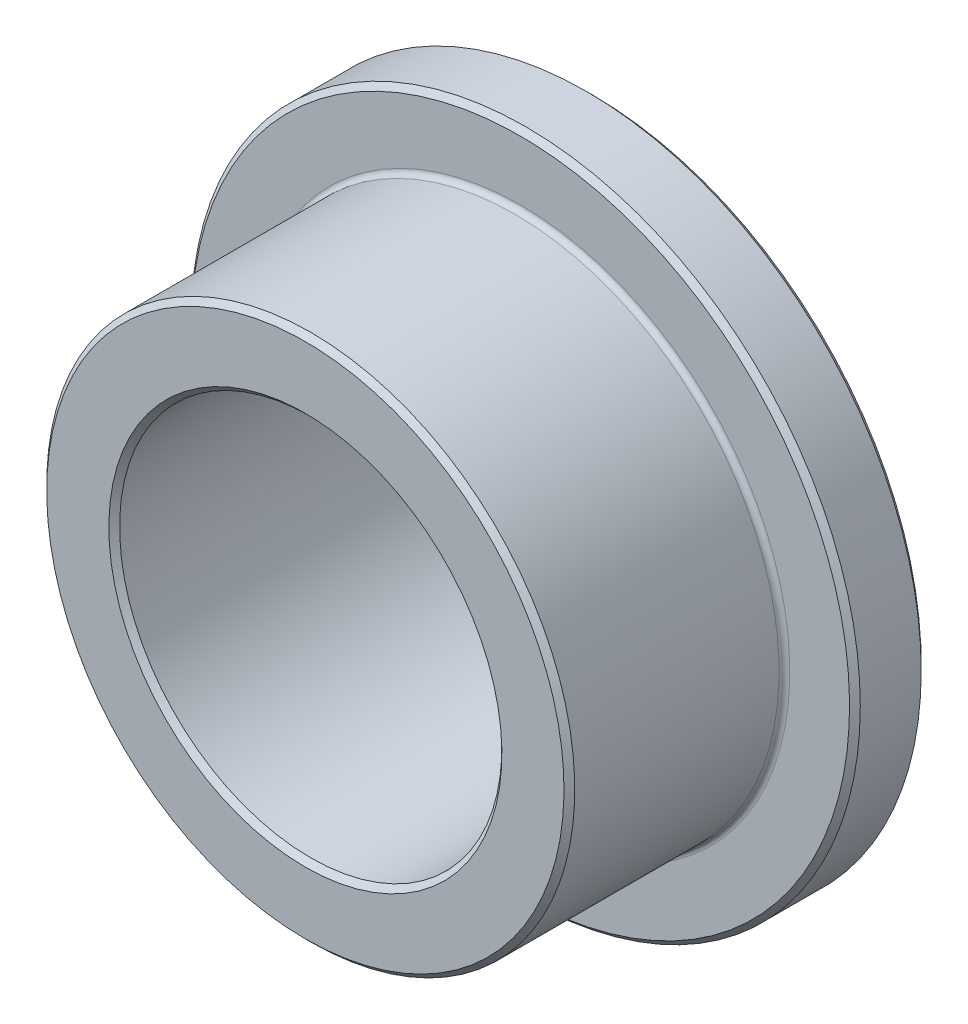
ISO-10303-21;
HEADER;
FILE_DESCRIPTION(('STEP AP214'),'2;1');
FILE_NAME('part.step','',(''),(''),'','','');
FILE_SCHEMA(('AUTOMOTIVE_DESIGN { 1 0 10303 214 1 1 1 1 }'));
ENDSEC;
DATA;
#1=APPLICATION_CONTEXT('core data for automotive mechanical design processes');
#2=APPLICATION_PROTOCOL_DEFINITION('international standard','automotive_design',2000,#1);
#3=PRODUCT_CONTEXT('',#1,'mechanical');
#4=PRODUCT('Part','Part','',(#3));
#5=PRODUCT_RELATED_PRODUCT_CATEGORY('part','',(#4));
#6=PRODUCT_DEFINITION_FORMATION('','',#4);
#7=PRODUCT_DEFINITION_CONTEXT('part definition',#1,'design');
#8=PRODUCT_DEFINITION('design','',#6,#7);
#9=PRODUCT_DEFINITION_SHAPE('','',#8);
#10=(LENGTH_UNIT() NAMED_UNIT(*) SI_UNIT(.MILLI.,.METRE.));
#11=(NAMED_UNIT(*) PLANE_ANGLE_UNIT() SI_UNIT($,.RADIAN.));
#12=(NAMED_UNIT(*) SI_UNIT($,.STERADIAN.) SOLID_ANGLE_UNIT());
#13=UNCERTAINTY_MEASURE_WITH_UNIT(LENGTH_MEASURE(1.E-05),#10,'distance_accuracy_value','');
#14=(GEOMETRIC_REPRESENTATION_CONTEXT(3) GLOBAL_UNCERTAINTY_ASSIGNED_CONTEXT((#13)) GLOBAL_UNIT_ASSIGNED_CONTEXT((#10,
#11,#12)) REPRESENTATION_CONTEXT('',''));
#15=CARTESIAN_POINT('',(0.,0.,0.));
#16=DIRECTION('',(0.,0.,1.));
#17=DIRECTION('',(1.,0.,0.));
#18=AXIS2_PLACEMENT_3D('',#15,#16,#17);
#19=CARTESIAN_POINT('',(0.,7.,-3.));
#20=DIRECTION('',(0.,0.,-1.));
#21=DIRECTION('',(0.,1.,0.));
#22=AXIS2_PLACEMENT_3D('',#19,#20,#21);
#23=PLANE('',#22);
#24=CARTESIAN_POINT('',(0.,0.,-3.));
#25=DIRECTION('',(0.,0.,-1.));
#26=DIRECTION('',(0.,1.,0.));
#27=AXIS2_PLACEMENT_3D('',#24,#25,#26);
#28=CIRCLE('',#27,6.8875);
#29=CARTESIAN_POINT('',(0.,6.8875,-3.));
#30=VERTEX_POINT('',#29);
#31=EDGE_CURVE('E70',#30,#30,#28,.T.);
#32=ORIENTED_EDGE('',*,*,#31,.T.);
#33=EDGE_LOOP('',(#32));
#34=FACE_BOUND('',#33,.T.);
#35=CARTESIAN_POINT('',(0.,0.,-3.));
#36=DIRECTION('',(0.,0.,-1.));
#37=DIRECTION('',(0.,1.,0.));
#38=AXIS2_PLACEMENT_3D('',#35,#36,#37);
#39=CIRCLE('',#38,4.);
#40=CARTESIAN_POINT('',(0.,4.,-3.));
#41=VERTEX_POINT('',#40);
#42=EDGE_CURVE('E73',#41,#41,#39,.T.);
#43=ORIENTED_EDGE('',*,*,#42,.F.);
#44=EDGE_LOOP('',(#43));
#45=FACE_BOUND('',#44,.T.);
#46=ADVANCED_FACE('F35',(#34,#45),#23,.T.);
#47=CARTESIAN_POINT('',(0.,0.,-3.));
#48=DIRECTION('',(0.,0.,-1.));
#49=DIRECTION('',(0.,1.,0.));
#50=AXIS2_PLACEMENT_3D('',#47,#48,#49);
#51=CYLINDRICAL_SURFACE('',#50,7.);
#52=CARTESIAN_POINT('',(0.,0.,-2.8875));
#53=DIRECTION('',(0.,0.,-1.));
#54=DIRECTION('',(0.,1.,0.));
#55=AXIS2_PLACEMENT_3D('',#52,#53,#54);
#56=CIRCLE('',#55,7.);
#57=CARTESIAN_POINT('',(0.,7.,-2.8875));
#58=VERTEX_POINT('',#57);
#59=EDGE_CURVE('E64',#58,#58,#56,.F.);
#60=ORIENTED_EDGE('',*,*,#59,.T.);
#61=EDGE_LOOP('',(#60));
#62=FACE_BOUND('',#61,.T.);
#63=CARTESIAN_POINT('',(0.,0.,-1.6125));
#64=DIRECTION('',(0.,0.,1.));
#65=DIRECTION('',(0.,-1.,0.));
#66=AXIS2_PLACEMENT_3D('',#63,#64,#65);
#67=CIRCLE('',#66,7.);
#68=CARTESIAN_POINT('',(0.,-7.,-1.6125));
#69=VERTEX_POINT('',#68);
#70=EDGE_CURVE('E67',#69,#69,#67,.F.);
#71=ORIENTED_EDGE('',*,*,#70,.T.);
#72=EDGE_LOOP('',(#71));
#73=FACE_BOUND('',#72,.T.);
#74=ADVANCED_FACE('F80',(#62,#73),#51,.T.);
#75=CARTESIAN_POINT('',(0.,7.,-1.5));
#76=DIRECTION('',(0.,0.,1.));
#77=DIRECTION('',(0.,-1.,0.));
#78=AXIS2_PLACEMENT_3D('',#75,#76,#77);
#79=PLANE('',#78);
#80=CARTESIAN_POINT('',(0.,0.,-1.5));
#81=DIRECTION('',(0.,0.,1.));
#82=DIRECTION('',(0.,-1.,0.));
#83=AXIS2_PLACEMENT_3D('',#80,#81,#82);
#84=CIRCLE('',#83,5.6375);
#85=CARTESIAN_POINT('',(0.,-5.6375,-1.5));
#86=VERTEX_POINT('',#85);
#87=EDGE_CURVE('E42',#86,#86,#84,.F.);
#88=ORIENTED_EDGE('',*,*,#87,.T.);
#89=EDGE_LOOP('',(#88));
#90=FACE_BOUND('',#89,.T.);
#91=CARTESIAN_POINT('',(0.,0.,-1.5));
#92=DIRECTION('',(0.,0.,1.));
#93=DIRECTION('',(0.,-1.,0.));
#94=AXIS2_PLACEMENT_3D('',#91,#92,#93);
#95=CIRCLE('',#94,6.8875);
#96=CARTESIAN_POINT('',(0.,-6.8875,-1.5));
#97=VERTEX_POINT('',#96);
#98=EDGE_CURVE('E61',#97,#97,#95,.T.);
#99=ORIENTED_EDGE('',*,*,#98,.T.);
#100=EDGE_LOOP('',(#99));
#101=FACE_BOUND('',#100,.T.);
#102=ADVANCED_FACE('F86',(#90,#101),#79,.T.);
#103=CARTESIAN_POINT('',(0.,0.,-3.));
#104=DIRECTION('',(0.,0.,-1.));
#105=DIRECTION('',(0.,1.,0.));
#106=AXIS2_PLACEMENT_3D('',#103,#104,#105);
#107=CYLINDRICAL_SURFACE('',#106,5.525);
#108=CARTESIAN_POINT('',(0.,0.,-1.3875));
#109=DIRECTION('',(0.,0.,1.));
#110=DIRECTION('',(0.,-1.,0.));
#111=AXIS2_PLACEMENT_3D('',#108,#109,#110);
#112=CIRCLE('',#111,5.525);
#113=CARTESIAN_POINT('',(0.,-5.525,-1.3875));
#114=VERTEX_POINT('',#113);
#115=EDGE_CURVE('E10',#114,#114,#112,.T.);
#116=ORIENTED_EDGE('',*,*,#115,.T.);
#117=EDGE_LOOP('',(#116));
#118=FACE_BOUND('',#117,.T.);
#119=CARTESIAN_POINT('',(0.,0.,2.8875));
#120=DIRECTION('',(0.,0.,1.));
#121=DIRECTION('',(0.,-1.,0.));
#122=AXIS2_PLACEMENT_3D('',#119,#120,#121);
#123=CIRCLE('',#122,5.525);
#124=CARTESIAN_POINT('',(0.,-5.525,2.8875));
#125=VERTEX_POINT('',#124);
#126=EDGE_CURVE('E58',#125,#125,#123,.F.);
#127=ORIENTED_EDGE('',*,*,#126,.T.);
#128=EDGE_LOOP('',(#127));
#129=FACE_BOUND('',#128,.T.);
#130=ADVANCED_FACE('F115',(#118,#129),#107,.T.);
#131=CARTESIAN_POINT('',(0.,5.525,3.));
#132=DIRECTION('',(0.,0.,1.));
#133=DIRECTION('',(0.,-1.,0.));
#134=AXIS2_PLACEMENT_3D('',#131,#132,#133);
#135=PLANE('',#134);
#136=CARTESIAN_POINT('',(0.,0.,3.));
#137=DIRECTION('',(0.,0.,1.));
#138=DIRECTION('',(0.,-1.,0.));
#139=AXIS2_PLACEMENT_3D('',#136,#137,#138);
#140=CIRCLE('',#139,5.4125);
#141=CARTESIAN_POINT('',(0.,-5.4125,3.));
#142=VERTEX_POINT('',#141);
#143=EDGE_CURVE('E50',#142,#142,#140,.T.);
#144=ORIENTED_EDGE('',*,*,#143,.T.);
#145=EDGE_LOOP('',(#144));
#146=FACE_BOUND('',#145,.T.);
#147=CARTESIAN_POINT('',(0.,0.,3.));
#148=DIRECTION('',(0.,0.,1.));
#149=DIRECTION('',(0.,-1.,0.));
#150=AXIS2_PLACEMENT_3D('',#147,#148,#149);
#151=CIRCLE('',#150,4.11250000000001);
#152=CARTESIAN_POINT('',(0.,-4.11250000000001,3.));
#153=VERTEX_POINT('',#152);
#154=EDGE_CURVE('E55',#153,#153,#151,.F.);
#155=ORIENTED_EDGE('',*,*,#154,.T.);
#156=EDGE_LOOP('',(#155));
#157=FACE_BOUND('',#156,.T.);
#158=ADVANCED_FACE('F113',(#146,#157),#135,.T.);
#159=CARTESIAN_POINT('',(0.,0.,-3.));
#160=DIRECTION('',(0.,0.,-1.));
#161=DIRECTION('',(0.,1.,0.));
#162=AXIS2_PLACEMENT_3D('',#159,#160,#161);
#163=CYLINDRICAL_SURFACE('',#162,4.);
#164=CARTESIAN_POINT('',(0.,0.,2.88749999999999));
#165=DIRECTION('',(0.,0.,1.));
#166=DIRECTION('',(0.,-1.,0.));
#167=AXIS2_PLACEMENT_3D('',#164,#165,#166);
#168=CIRCLE('',#167,4.);
#169=CARTESIAN_POINT('',(0.,-4.,2.88749999999999));
#170=VERTEX_POINT('',#169);
#171=EDGE_CURVE('E46',#170,#170,#168,.T.);
#172=ORIENTED_EDGE('',*,*,#171,.T.);
#173=EDGE_LOOP('',(#172));
#174=FACE_BOUND('',#173,.T.);
#175=ORIENTED_EDGE('',*,*,#42,.T.);
#176=EDGE_LOOP('',(#175));
#177=FACE_BOUND('',#176,.T.);
#178=ADVANCED_FACE('F77',(#174,#177),#163,.F.);
#179=CARTESIAN_POINT('',(0.,0.,-3.));
#180=DIRECTION('',(0.,0.,1.));
#181=DIRECTION('',(0.,-1.,0.));
#182=AXIS2_PLACEMENT_3D('',#179,#180,#181);
#183=CONICAL_SURFACE('',#182,6.8875,0.785398163397441);
#184=ORIENTED_EDGE('',*,*,#59,.F.);
#185=EDGE_LOOP('',(#184));
#186=FACE_BOUND('',#185,.T.);
#187=ORIENTED_EDGE('',*,*,#31,.F.);
#188=EDGE_LOOP('',(#187));
#189=FACE_BOUND('',#188,.T.);
#190=ADVANCED_FACE('F91',(#186,#189),#183,.T.);
#191=CARTESIAN_POINT('',(0.,0.,-1.6125));
#192=DIRECTION('',(0.,0.,-1.));
#193=DIRECTION('',(0.,1.,0.));
#194=AXIS2_PLACEMENT_3D('',#191,#192,#193);
#195=CONICAL_SURFACE('',#194,7.,0.785398163397452);
#196=ORIENTED_EDGE('',*,*,#98,.F.);
#197=EDGE_LOOP('',(#196));
#198=FACE_BOUND('',#197,.T.);
#199=ORIENTED_EDGE('',*,*,#70,.F.);
#200=EDGE_LOOP('',(#199));
#201=FACE_BOUND('',#200,.T.);
#202=ADVANCED_FACE('F94',(#198,#201),#195,.T.);
#203=CARTESIAN_POINT('',(0.,0.,2.8875));
#204=DIRECTION('',(0.,0.,-1.));
#205=DIRECTION('',(0.,1.,0.));
#206=AXIS2_PLACEMENT_3D('',#203,#204,#205);
#207=CONICAL_SURFACE('',#206,5.525,0.78539816339746);
#208=ORIENTED_EDGE('',*,*,#143,.F.);
#209=EDGE_LOOP('',(#208));
#210=FACE_BOUND('',#209,.T.);
#211=ORIENTED_EDGE('',*,*,#126,.F.);
#212=EDGE_LOOP('',(#211));
#213=FACE_BOUND('',#212,.T.);
#214=ADVANCED_FACE('F98',(#210,#213),#207,.T.);
#215=CARTESIAN_POINT('',(0.,0.,3.));
#216=DIRECTION('',(0.,0.,1.));
#217=DIRECTION('',(0.,-1.,0.));
#218=AXIS2_PLACEMENT_3D('',#215,#216,#217);
#219=CONICAL_SURFACE('',#218,4.11250000000001,0.785398163397448);
#220=ORIENTED_EDGE('',*,*,#171,.F.);
#221=EDGE_LOOP('',(#220));
#222=FACE_BOUND('',#221,.T.);
#223=ORIENTED_EDGE('',*,*,#154,.F.);
#224=EDGE_LOOP('',(#223));
#225=FACE_BOUND('',#224,.T.);
#226=ADVANCED_FACE('F101',(#222,#225),#219,.F.);
#227=CARTESIAN_POINT('',(0.,0.,-1.3875));
#228=DIRECTION('',(0.,0.,1.));
#229=DIRECTION('',(0.,-1.,0.));
#230=AXIS2_PLACEMENT_3D('',#227,#228,#229);
#231=TOROIDAL_SURFACE('',#230,5.6375,0.1125);
#232=ORIENTED_EDGE('',*,*,#115,.F.);
#233=EDGE_LOOP('',(#232));
#234=FACE_BOUND('',#233,.T.);
#235=ORIENTED_EDGE('',*,*,#87,.F.);
#236=EDGE_LOOP('',(#235));
#237=FACE_BOUND('',#236,.T.);
#238=ADVANCED_FACE('F37',(#234,#237),#231,.F.);
#239=CLOSED_SHELL('',(#46,#74,#102,#130,#158,#178,#190,#202,#214,#226,#238));
#240=MANIFOLD_SOLID_BREP('B2',#239);
#241=ADVANCED_BREP_SHAPE_REPRESENTATION('',(#18,#240),#14);
#242=SHAPE_DEFINITION_REPRESENTATION(#9,#241);
ENDSEC;
END-ISO-10303-21;
